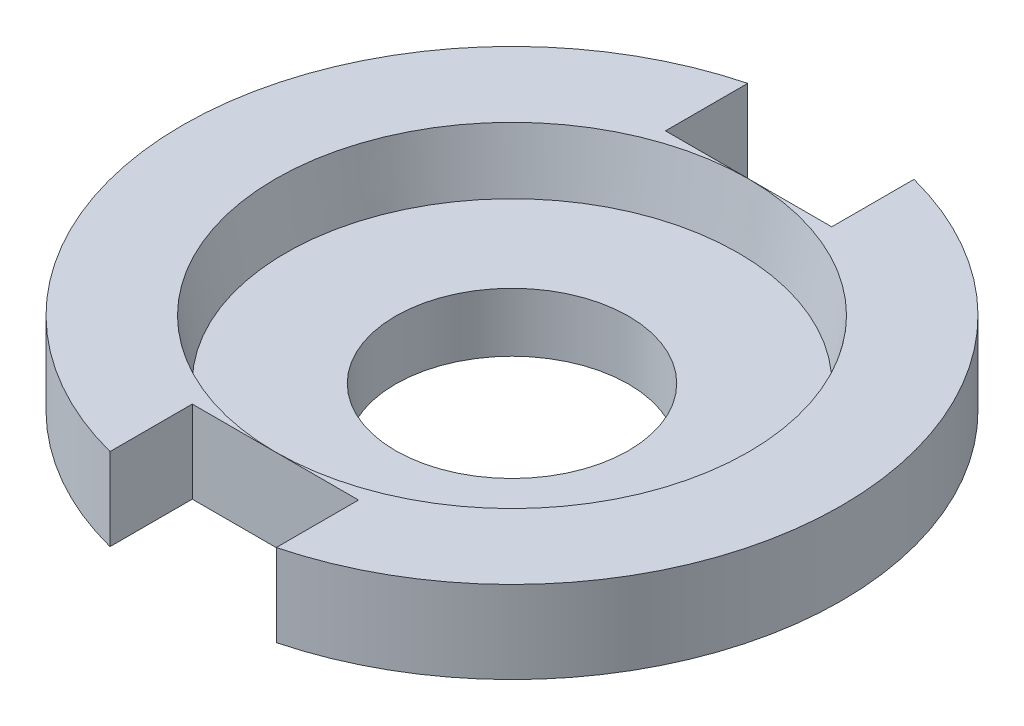
ISO-10303-21;
HEADER;
FILE_DESCRIPTION(('STEP AP214'),'2;1');
FILE_NAME('part.step','',(''),(''),'','','');
FILE_SCHEMA(('AUTOMOTIVE_DESIGN { 1 0 10303 214 1 1 1 1 }'));
ENDSEC;
DATA;
#1=APPLICATION_CONTEXT('core data for automotive mechanical design processes');
#2=APPLICATION_PROTOCOL_DEFINITION('international standard','automotive_design',2000,#1);
#3=PRODUCT_CONTEXT('',#1,'mechanical');
#4=PRODUCT('Part','Part','',(#3));
#5=PRODUCT_RELATED_PRODUCT_CATEGORY('part','',(#4));
#6=PRODUCT_DEFINITION_FORMATION('','',#4);
#7=PRODUCT_DEFINITION_CONTEXT('part definition',#1,'design');
#8=PRODUCT_DEFINITION('design','',#6,#7);
#9=PRODUCT_DEFINITION_SHAPE('','',#8);
#10=(LENGTH_UNIT() NAMED_UNIT(*) SI_UNIT(.MILLI.,.METRE.));
#11=(NAMED_UNIT(*) PLANE_ANGLE_UNIT() SI_UNIT($,.RADIAN.));
#12=(NAMED_UNIT(*) SI_UNIT($,.STERADIAN.) SOLID_ANGLE_UNIT());
#13=UNCERTAINTY_MEASURE_WITH_UNIT(LENGTH_MEASURE(1.E-05),#10,'distance_accuracy_value','');
#14=(GEOMETRIC_REPRESENTATION_CONTEXT(3) GLOBAL_UNCERTAINTY_ASSIGNED_CONTEXT((#13)) GLOBAL_UNIT_ASSIGNED_CONTEXT((#10,
#11,#12)) REPRESENTATION_CONTEXT('',''));
#15=CARTESIAN_POINT('',(0.,0.,0.));
#16=DIRECTION('',(0.,0.,1.));
#17=DIRECTION('',(1.,0.,0.));
#18=AXIS2_PLACEMENT_3D('',#15,#16,#17);
#19=CARTESIAN_POINT('',(0.,5.,0.));
#20=DIRECTION('',(0.,-1.,0.));
#21=DIRECTION('',(0.,0.,-1.));
#22=AXIS2_PLACEMENT_3D('',#19,#20,#21);
#23=CYLINDRICAL_SURFACE('',#22,28.);
#24=DIRECTION('',(0.,-1.,0.));
#25=VECTOR('',#24,1.);
#26=CARTESIAN_POINT('',(-7.06296585006992,5.,-27.0945476692405));
#27=LINE('',#26,#25);
#28=CARTESIAN_POINT('',(-7.06296585006992,5.,-27.0945476692405));
#29=VERTEX_POINT('',#28);
#30=CARTESIAN_POINT('',(-7.06296585006992,-2.,-27.0945476692405));
#31=VERTEX_POINT('',#30);
#32=EDGE_CURVE('E133',#29,#31,#27,.T.);
#33=ORIENTED_EDGE('',*,*,#32,.T.);
#34=CARTESIAN_POINT('',(0.,-2.,0.));
#35=DIRECTION('',(0.,-1.,0.));
#36=DIRECTION('',(0.,0.,-1.));
#37=AXIS2_PLACEMENT_3D('',#34,#35,#36);
#38=CIRCLE('',#37,28.);
#39=CARTESIAN_POINT('',(-7.0629658500699,-2.,27.0945476692405));
#40=VERTEX_POINT('',#39);
#41=EDGE_CURVE('E170',#40,#31,#38,.T.);
#42=ORIENTED_EDGE('',*,*,#41,.F.);
#43=DIRECTION('',(0.,-1.,0.));
#44=VECTOR('',#43,1.);
#45=CARTESIAN_POINT('',(-7.0629658500699,5.,27.0945476692405));
#46=LINE('',#45,#44);
#47=CARTESIAN_POINT('',(-7.0629658500699,5.,27.0945476692405));
#48=VERTEX_POINT('',#47);
#49=EDGE_CURVE('E154',#48,#40,#46,.T.);
#50=ORIENTED_EDGE('',*,*,#49,.F.);
#51=CARTESIAN_POINT('',(0.,5.,0.));
#52=DIRECTION('',(0.,1.,0.));
#53=DIRECTION('',(0.,0.,1.));
#54=AXIS2_PLACEMENT_3D('',#51,#52,#53);
#55=CIRCLE('',#54,28.);
#56=EDGE_CURVE('E44',#29,#48,#55,.T.);
#57=ORIENTED_EDGE('',*,*,#56,.F.);
#58=EDGE_LOOP('',(#33,#42,#50,#57));
#59=FACE_BOUND('',#58,.T.);
#60=ADVANCED_FACE('F35',(#59),#23,.T.);
#61=CARTESIAN_POINT('',(7.06296585006974,-2.,-27.0945476692406));
#62=VERTEX_POINT('',#61);
#63=CARTESIAN_POINT('',(7.06296585006976,-2.,27.0945476692405));
#64=VERTEX_POINT('',#63);
#65=EDGE_CURVE('E167',#62,#64,#38,.T.);
#66=ORIENTED_EDGE('',*,*,#65,.F.);
#67=DIRECTION('',(0.,-1.,0.));
#68=VECTOR('',#67,1.);
#69=CARTESIAN_POINT('',(7.06296585006974,5.,-27.0945476692406));
#70=LINE('',#69,#68);
#71=CARTESIAN_POINT('',(7.06296585006974,5.,-27.0945476692406));
#72=VERTEX_POINT('',#71);
#73=EDGE_CURVE('E131',#72,#62,#70,.T.);
#74=ORIENTED_EDGE('',*,*,#73,.F.);
#75=CARTESIAN_POINT('',(7.06296585006976,5.,27.0945476692405));
#76=VERTEX_POINT('',#75);
#77=EDGE_CURVE('E11',#76,#72,#55,.T.);
#78=ORIENTED_EDGE('',*,*,#77,.F.);
#79=DIRECTION('',(0.,-1.,0.));
#80=VECTOR('',#79,1.);
#81=CARTESIAN_POINT('',(7.06296585006976,5.,27.0945476692405));
#82=LINE('',#81,#80);
#83=EDGE_CURVE('E156',#76,#64,#82,.T.);
#84=ORIENTED_EDGE('',*,*,#83,.T.);
#85=EDGE_LOOP('',(#66,#74,#78,#84));
#86=FACE_BOUND('',#85,.T.);
#87=ADVANCED_FACE('F37',(#86),#23,.T.);
#88=CARTESIAN_POINT('',(0.,5.,0.));
#89=DIRECTION('',(0.,1.,0.));
#90=DIRECTION('',(0.,0.,1.));
#91=AXIS2_PLACEMENT_3D('',#88,#89,#90);
#92=PLANE('',#91);
#93=DIRECTION('',(0.,0.,1.));
#94=VECTOR('',#93,1.);
#95=CARTESIAN_POINT('',(7.06296585006982,5.,0.));
#96=LINE('',#95,#94);
#97=CARTESIAN_POINT('',(7.06296585006976,5.,-20.1051620494184));
#98=VERTEX_POINT('',#97);
#99=EDGE_CURVE('E103',#72,#98,#96,.T.);
#100=ORIENTED_EDGE('',*,*,#99,.T.);
#101=DIRECTION('',(-1.,0.,0.));
#102=VECTOR('',#101,1.);
#103=CARTESIAN_POINT('',(0.,5.,-20.1051620494184));
#104=LINE('',#103,#102);
#105=CARTESIAN_POINT('',(-7.0629658500699,5.,-20.1051620494184));
#106=VERTEX_POINT('',#105);
#107=EDGE_CURVE('E113',#98,#106,#104,.T.);
#108=ORIENTED_EDGE('',*,*,#107,.T.);
#109=DIRECTION('',(0.,0.,1.));
#110=VECTOR('',#109,1.);
#111=CARTESIAN_POINT('',(-7.06296585006985,5.,0.));
#112=LINE('',#111,#110);
#113=EDGE_CURVE('E109',#29,#106,#112,.T.);
#114=ORIENTED_EDGE('',*,*,#113,.F.);
#115=ORIENTED_EDGE('',*,*,#56,.T.);
#116=DIRECTION('',(0.,0.,1.));
#117=VECTOR('',#116,1.);
#118=CARTESIAN_POINT('',(-7.0629658500699,5.,0.));
#119=LINE('',#118,#117);
#120=CARTESIAN_POINT('',(-7.0629658500699,5.,20.1051620494184));
#121=VERTEX_POINT('',#120);
#122=EDGE_CURVE('E142',#121,#48,#119,.T.);
#123=ORIENTED_EDGE('',*,*,#122,.F.);
#124=DIRECTION('',(-1.,0.,0.));
#125=VECTOR('',#124,1.);
#126=CARTESIAN_POINT('',(0.,5.,20.1051620494184));
#127=LINE('',#126,#125);
#128=CARTESIAN_POINT('',(7.06296585006976,5.,20.1051620494184));
#129=VERTEX_POINT('',#128);
#130=EDGE_CURVE('E137',#129,#121,#127,.T.);
#131=ORIENTED_EDGE('',*,*,#130,.F.);
#132=DIRECTION('',(0.,0.,1.));
#133=VECTOR('',#132,1.);
#134=CARTESIAN_POINT('',(7.06296585006976,5.,0.));
#135=LINE('',#134,#133);
#136=EDGE_CURVE('E139',#129,#76,#135,.T.);
#137=ORIENTED_EDGE('',*,*,#136,.T.);
#138=ORIENTED_EDGE('',*,*,#77,.T.);
#139=EDGE_LOOP('',(#100,#108,#114,#115,#123,#131,#137,#138));
#140=FACE_BOUND('',#139,.T.);
#141=CARTESIAN_POINT('',(0.,5.,0.));
#142=DIRECTION('',(0.,1.,0.));
#143=DIRECTION('',(0.,0.,1.));
#144=AXIS2_PLACEMENT_3D('',#141,#142,#143);
#145=CIRCLE('',#144,20.1);
#146=CARTESIAN_POINT('',(0.,5.,20.1));
#147=VERTEX_POINT('',#146);
#148=EDGE_CURVE('E173',#147,#147,#145,.T.);
#149=ORIENTED_EDGE('',*,*,#148,.F.);
#150=EDGE_LOOP('',(#149));
#151=FACE_BOUND('',#150,.T.);
#152=ADVANCED_FACE('F118',(#140,#151),#92,.T.);
#153=CARTESIAN_POINT('',(0.,-2.,0.));
#154=DIRECTION('',(0.,-1.,0.));
#155=DIRECTION('',(0.,0.,-1.));
#156=AXIS2_PLACEMENT_3D('',#153,#154,#155);
#157=PLANE('',#156);
#158=DIRECTION('',(0.,0.,1.));
#159=VECTOR('',#158,1.);
#160=CARTESIAN_POINT('',(7.06296585006982,-2.,0.));
#161=LINE('',#160,#159);
#162=CARTESIAN_POINT('',(7.06296585006976,-2.,-20.1051620494184));
#163=VERTEX_POINT('',#162);
#164=EDGE_CURVE('E51',#62,#163,#161,.T.);
#165=ORIENTED_EDGE('',*,*,#164,.F.);
#166=ORIENTED_EDGE('',*,*,#65,.T.);
#167=DIRECTION('',(0.,0.,1.));
#168=VECTOR('',#167,1.);
#169=CARTESIAN_POINT('',(7.06296585006976,-2.,0.));
#170=LINE('',#169,#168);
#171=CARTESIAN_POINT('',(7.06296585006976,-2.,20.1051620494184));
#172=VERTEX_POINT('',#171);
#173=EDGE_CURVE('E147',#172,#64,#170,.T.);
#174=ORIENTED_EDGE('',*,*,#173,.F.);
#175=DIRECTION('',(-1.,0.,0.));
#176=VECTOR('',#175,1.);
#177=CARTESIAN_POINT('',(0.,-2.,20.1051620494184));
#178=LINE('',#177,#176);
#179=CARTESIAN_POINT('',(-7.0629658500699,-2.,20.1051620494184));
#180=VERTEX_POINT('',#179);
#181=EDGE_CURVE('E59',#172,#180,#178,.T.);
#182=ORIENTED_EDGE('',*,*,#181,.T.);
#183=DIRECTION('',(0.,0.,1.));
#184=VECTOR('',#183,1.);
#185=CARTESIAN_POINT('',(-7.0629658500699,-2.,0.));
#186=LINE('',#185,#184);
#187=EDGE_CURVE('E140',#180,#40,#186,.T.);
#188=ORIENTED_EDGE('',*,*,#187,.T.);
#189=ORIENTED_EDGE('',*,*,#41,.T.);
#190=DIRECTION('',(0.,0.,1.));
#191=VECTOR('',#190,1.);
#192=CARTESIAN_POINT('',(-7.06296585006985,-2.,0.));
#193=LINE('',#192,#191);
#194=CARTESIAN_POINT('',(-7.0629658500699,-2.,-20.1051620494184));
#195=VERTEX_POINT('',#194);
#196=EDGE_CURVE('E122',#31,#195,#193,.T.);
#197=ORIENTED_EDGE('',*,*,#196,.T.);
#198=DIRECTION('',(-1.,0.,0.));
#199=VECTOR('',#198,1.);
#200=CARTESIAN_POINT('',(0.,-2.,-20.1051620494184));
#201=LINE('',#200,#199);
#202=EDGE_CURVE('E125',#163,#195,#201,.T.);
#203=ORIENTED_EDGE('',*,*,#202,.F.);
#204=EDGE_LOOP('',(#165,#166,#174,#182,#188,#189,#197,#203));
#205=FACE_BOUND('',#204,.T.);
#206=CARTESIAN_POINT('',(0.,-2.,0.));
#207=DIRECTION('',(0.,-1.,0.));
#208=DIRECTION('',(0.,0.,-1.));
#209=AXIS2_PLACEMENT_3D('',#206,#207,#208);
#210=CIRCLE('',#209,14.9);
#211=CARTESIAN_POINT('',(0.,-2.,-14.9));
#212=VERTEX_POINT('',#211);
#213=EDGE_CURVE('E163',#212,#212,#210,.T.);
#214=ORIENTED_EDGE('',*,*,#213,.F.);
#215=EDGE_LOOP('',(#214));
#216=FACE_BOUND('',#215,.T.);
#217=ADVANCED_FACE('F190',(#205,#216),#157,.T.);
#218=CARTESIAN_POINT('',(0.,5.,0.));
#219=DIRECTION('',(0.,1.,0.));
#220=DIRECTION('',(0.,0.,1.));
#221=AXIS2_PLACEMENT_3D('',#218,#219,#220);
#222=CONICAL_SURFACE('',#221,20.1,0.174532925199434);
#223=CARTESIAN_POINT('',(0.,0.,0.));
#224=DIRECTION('',(0.,1.,0.));
#225=DIRECTION('',(0.,0.,1.));
#226=AXIS2_PLACEMENT_3D('',#223,#224,#225);
#227=CIRCLE('',#226,19.2183650964577);
#228=CARTESIAN_POINT('',(0.,0.,19.2183650964577));
#229=VERTEX_POINT('',#228);
#230=EDGE_CURVE('E176',#229,#229,#227,.T.);
#231=ORIENTED_EDGE('',*,*,#230,.F.);
#232=EDGE_LOOP('',(#231));
#233=FACE_BOUND('',#232,.T.);
#234=ORIENTED_EDGE('',*,*,#148,.T.);
#235=EDGE_LOOP('',(#234));
#236=FACE_BOUND('',#235,.T.);
#237=ADVANCED_FACE('F219',(#233,#236),#222,.F.);
#238=CARTESIAN_POINT('',(0.,0.,0.));
#239=DIRECTION('',(0.,-1.,0.));
#240=DIRECTION('',(0.,0.,-1.));
#241=AXIS2_PLACEMENT_3D('',#238,#239,#240);
#242=PLANE('',#241);
#243=CARTESIAN_POINT('',(0.,0.,0.));
#244=DIRECTION('',(0.,-1.,0.));
#245=DIRECTION('',(0.,0.,-1.));
#246=AXIS2_PLACEMENT_3D('',#243,#244,#245);
#247=CIRCLE('',#246,9.9);
#248=CARTESIAN_POINT('',(0.,0.,-9.9));
#249=VERTEX_POINT('',#248);
#250=EDGE_CURVE('E39',#249,#249,#247,.T.);
#251=ORIENTED_EDGE('',*,*,#250,.T.);
#252=EDGE_LOOP('',(#251));
#253=FACE_BOUND('',#252,.T.);
#254=ORIENTED_EDGE('',*,*,#230,.T.);
#255=EDGE_LOOP('',(#254));
#256=FACE_BOUND('',#255,.T.);
#257=ADVANCED_FACE('F224',(#253,#256),#242,.F.);
#258=CARTESIAN_POINT('',(0.,-5.,0.));
#259=DIRECTION('',(0.,-1.,0.));
#260=DIRECTION('',(0.,0.,-1.));
#261=AXIS2_PLACEMENT_3D('',#258,#259,#260);
#262=PLANE('',#261);
#263=CARTESIAN_POINT('',(0.,-5.,0.));
#264=DIRECTION('',(0.,-1.,0.));
#265=DIRECTION('',(0.,0.,-1.));
#266=AXIS2_PLACEMENT_3D('',#263,#264,#265);
#267=CIRCLE('',#266,14.9);
#268=CARTESIAN_POINT('',(0.,-5.,-14.9));
#269=VERTEX_POINT('',#268);
#270=EDGE_CURVE('E164',#269,#269,#267,.T.);
#271=ORIENTED_EDGE('',*,*,#270,.T.);
#272=EDGE_LOOP('',(#271));
#273=FACE_BOUND('',#272,.T.);
#274=CARTESIAN_POINT('',(0.,-5.,0.));
#275=DIRECTION('',(0.,-1.,0.));
#276=DIRECTION('',(0.,0.,-1.));
#277=AXIS2_PLACEMENT_3D('',#274,#275,#276);
#278=CIRCLE('',#277,9.9);
#279=CARTESIAN_POINT('',(0.,-5.,-9.9));
#280=VERTEX_POINT('',#279);
#281=EDGE_CURVE('E160',#280,#280,#278,.T.);
#282=ORIENTED_EDGE('',*,*,#281,.F.);
#283=EDGE_LOOP('',(#282));
#284=FACE_BOUND('',#283,.T.);
#285=ADVANCED_FACE('F227',(#273,#284),#262,.T.);
#286=CARTESIAN_POINT('',(0.,-5.,0.));
#287=DIRECTION('',(0.,1.,0.));
#288=DIRECTION('',(0.,0.,1.));
#289=AXIS2_PLACEMENT_3D('',#286,#287,#288);
#290=CYLINDRICAL_SURFACE('',#289,14.9);
#291=ORIENTED_EDGE('',*,*,#270,.F.);
#292=EDGE_LOOP('',(#291));
#293=FACE_BOUND('',#292,.T.);
#294=ORIENTED_EDGE('',*,*,#213,.T.);
#295=EDGE_LOOP('',(#294));
#296=FACE_BOUND('',#295,.T.);
#297=ADVANCED_FACE('F230',(#293,#296),#290,.T.);
#298=CARTESIAN_POINT('',(0.,-5.,0.));
#299=DIRECTION('',(0.,1.,0.));
#300=DIRECTION('',(0.,0.,1.));
#301=AXIS2_PLACEMENT_3D('',#298,#299,#300);
#302=CYLINDRICAL_SURFACE('',#301,9.9);
#303=ORIENTED_EDGE('',*,*,#281,.T.);
#304=EDGE_LOOP('',(#303));
#305=FACE_BOUND('',#304,.T.);
#306=ORIENTED_EDGE('',*,*,#250,.F.);
#307=EDGE_LOOP('',(#306));
#308=FACE_BOUND('',#307,.T.);
#309=ADVANCED_FACE('F233',(#305,#308),#302,.F.);
#310=CARTESIAN_POINT('',(0.,5.,20.1051620494184));
#311=DIRECTION('',(0.,0.,1.));
#312=DIRECTION('',(1.,0.,0.));
#313=AXIS2_PLACEMENT_3D('',#310,#311,#312);
#314=PLANE('',#313);
#315=ORIENTED_EDGE('',*,*,#181,.F.);
#316=DIRECTION('',(0.,-1.,0.));
#317=VECTOR('',#316,1.);
#318=CARTESIAN_POINT('',(7.06296585006976,5.,20.1051620494184));
#319=LINE('',#318,#317);
#320=EDGE_CURVE('E145',#129,#172,#319,.T.);
#321=ORIENTED_EDGE('',*,*,#320,.F.);
#322=ORIENTED_EDGE('',*,*,#130,.T.);
#323=DIRECTION('',(0.,-1.,0.));
#324=VECTOR('',#323,1.);
#325=CARTESIAN_POINT('',(-7.0629658500699,5.,20.1051620494184));
#326=LINE('',#325,#324);
#327=EDGE_CURVE('E152',#121,#180,#326,.T.);
#328=ORIENTED_EDGE('',*,*,#327,.T.);
#329=EDGE_LOOP('',(#315,#321,#322,#328));
#330=FACE_BOUND('',#329,.T.);
#331=ADVANCED_FACE('F193',(#330),#314,.T.);
#332=CARTESIAN_POINT('',(-7.0629658500699,5.,0.));
#333=DIRECTION('',(1.,0.,0.));
#334=DIRECTION('',(0.,0.,-1.));
#335=AXIS2_PLACEMENT_3D('',#332,#333,#334);
#336=PLANE('',#335);
#337=ORIENTED_EDGE('',*,*,#187,.F.);
#338=ORIENTED_EDGE('',*,*,#327,.F.);
#339=ORIENTED_EDGE('',*,*,#122,.T.);
#340=ORIENTED_EDGE('',*,*,#49,.T.);
#341=EDGE_LOOP('',(#337,#338,#339,#340));
#342=FACE_BOUND('',#341,.T.);
#343=ADVANCED_FACE('F187',(#342),#336,.T.);
#344=CARTESIAN_POINT('',(7.06296585006976,5.,0.));
#345=DIRECTION('',(1.,0.,0.));
#346=DIRECTION('',(0.,0.,-1.));
#347=AXIS2_PLACEMENT_3D('',#344,#345,#346);
#348=PLANE('',#347);
#349=ORIENTED_EDGE('',*,*,#173,.T.);
#350=ORIENTED_EDGE('',*,*,#83,.F.);
#351=ORIENTED_EDGE('',*,*,#136,.F.);
#352=ORIENTED_EDGE('',*,*,#320,.T.);
#353=EDGE_LOOP('',(#349,#350,#351,#352));
#354=FACE_BOUND('',#353,.T.);
#355=ADVANCED_FACE('F198',(#354),#348,.F.);
#356=CARTESIAN_POINT('',(7.06296585006982,5.,0.));
#357=DIRECTION('',(1.,0.,0.));
#358=DIRECTION('',(0.,0.,-1.));
#359=AXIS2_PLACEMENT_3D('',#356,#357,#358);
#360=PLANE('',#359);
#361=ORIENTED_EDGE('',*,*,#164,.T.);
#362=DIRECTION('',(0.,-1.,0.));
#363=VECTOR('',#362,1.);
#364=CARTESIAN_POINT('',(7.06296585006976,5.,-20.1051620494184));
#365=LINE('',#364,#363);
#366=EDGE_CURVE('E99',#98,#163,#365,.T.);
#367=ORIENTED_EDGE('',*,*,#366,.F.);
#368=ORIENTED_EDGE('',*,*,#99,.F.);
#369=ORIENTED_EDGE('',*,*,#73,.T.);
#370=EDGE_LOOP('',(#361,#367,#368,#369));
#371=FACE_BOUND('',#370,.T.);
#372=ADVANCED_FACE('F101',(#371),#360,.F.);
#373=CARTESIAN_POINT('',(-7.06296585006985,5.,0.));
#374=DIRECTION('',(1.,0.,0.));
#375=DIRECTION('',(0.,0.,-1.));
#376=AXIS2_PLACEMENT_3D('',#373,#374,#375);
#377=PLANE('',#376);
#378=ORIENTED_EDGE('',*,*,#196,.F.);
#379=ORIENTED_EDGE('',*,*,#32,.F.);
#380=ORIENTED_EDGE('',*,*,#113,.T.);
#381=DIRECTION('',(0.,-1.,0.));
#382=VECTOR('',#381,1.);
#383=CARTESIAN_POINT('',(-7.0629658500699,5.,-20.1051620494184));
#384=LINE('',#383,#382);
#385=EDGE_CURVE('E108',#106,#195,#384,.T.);
#386=ORIENTED_EDGE('',*,*,#385,.T.);
#387=EDGE_LOOP('',(#378,#379,#380,#386));
#388=FACE_BOUND('',#387,.T.);
#389=ADVANCED_FACE('F205',(#388),#377,.T.);
#390=CARTESIAN_POINT('',(0.,5.,-20.1051620494184));
#391=DIRECTION('',(0.,0.,1.));
#392=DIRECTION('',(1.,0.,0.));
#393=AXIS2_PLACEMENT_3D('',#390,#391,#392);
#394=PLANE('',#393);
#395=ORIENTED_EDGE('',*,*,#202,.T.);
#396=ORIENTED_EDGE('',*,*,#385,.F.);
#397=ORIENTED_EDGE('',*,*,#107,.F.);
#398=ORIENTED_EDGE('',*,*,#366,.T.);
#399=EDGE_LOOP('',(#395,#396,#397,#398));
#400=FACE_BOUND('',#399,.T.);
#401=ADVANCED_FACE('F114',(#400),#394,.F.);
#402=CLOSED_SHELL('',(#60,#87,#152,#217,#237,#257,#285,#297,#309,#331,#343,#355,#372,#389,#401));
#403=MANIFOLD_SOLID_BREP('B2',#402);
#404=ADVANCED_BREP_SHAPE_REPRESENTATION('',(#18,#403),#14);
#405=SHAPE_DEFINITION_REPRESENTATION(#9,#404);
ENDSEC;
END-ISO-10303-21;
